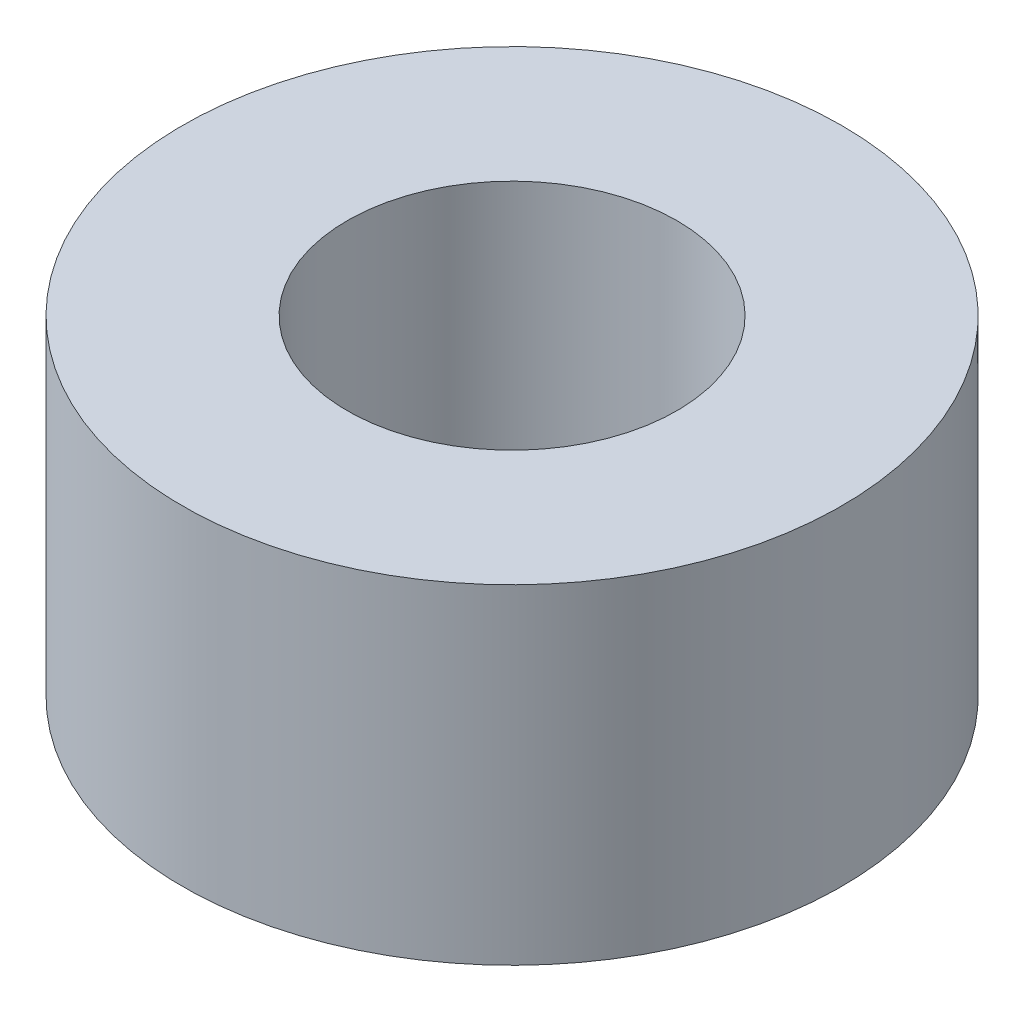
ISO-10303-21;
HEADER;
FILE_DESCRIPTION(('STEP AP214'),'2;1');
FILE_NAME('part.step','',(''),(''),'','','');
FILE_SCHEMA(('AUTOMOTIVE_DESIGN { 1 0 10303 214 1 1 1 1 }'));
ENDSEC;
DATA;
#1=APPLICATION_CONTEXT('core data for automotive mechanical design processes');
#2=APPLICATION_PROTOCOL_DEFINITION('international standard','automotive_design',2000,#1);
#3=PRODUCT_CONTEXT('',#1,'mechanical');
#4=PRODUCT('Part','Part','',(#3));
#5=PRODUCT_RELATED_PRODUCT_CATEGORY('part','',(#4));
#6=PRODUCT_DEFINITION_FORMATION('','',#4);
#7=PRODUCT_DEFINITION_CONTEXT('part definition',#1,'design');
#8=PRODUCT_DEFINITION('design','',#6,#7);
#9=PRODUCT_DEFINITION_SHAPE('','',#8);
#10=(LENGTH_UNIT() NAMED_UNIT(*) SI_UNIT(.MILLI.,.METRE.));
#11=(NAMED_UNIT(*) PLANE_ANGLE_UNIT() SI_UNIT($,.RADIAN.));
#12=(NAMED_UNIT(*) SI_UNIT($,.STERADIAN.) SOLID_ANGLE_UNIT());
#13=UNCERTAINTY_MEASURE_WITH_UNIT(LENGTH_MEASURE(1.E-05),#10,'distance_accuracy_value','');
#14=(GEOMETRIC_REPRESENTATION_CONTEXT(3) GLOBAL_UNCERTAINTY_ASSIGNED_CONTEXT((#13)) GLOBAL_UNIT_ASSIGNED_CONTEXT((#10,
#11,#12)) REPRESENTATION_CONTEXT('',''));
#15=CARTESIAN_POINT('',(0.,0.,0.));
#16=DIRECTION('',(0.,0.,1.));
#17=DIRECTION('',(1.,0.,0.));
#18=AXIS2_PLACEMENT_3D('',#15,#16,#17);
#19=CARTESIAN_POINT('',(0.,-19.05,176.994115114212));
#20=DIRECTION('',(0.,-1.,0.));
#21=DIRECTION('',(0.,0.,-1.));
#22=AXIS2_PLACEMENT_3D('',#19,#20,#21);
#23=CYLINDRICAL_SURFACE('',#22,9.525);
#24=CARTESIAN_POINT('',(0.,0.,176.994115114212));
#25=DIRECTION('',(0.,-1.,0.));
#26=DIRECTION('',(0.,0.,-1.));
#27=AXIS2_PLACEMENT_3D('',#24,#25,#26);
#28=CIRCLE('',#27,9.525);
#29=CARTESIAN_POINT('',(0.,0.,167.469115114212));
#30=VERTEX_POINT('',#29);
#31=EDGE_CURVE('E24',#30,#30,#28,.F.);
#32=ORIENTED_EDGE('',*,*,#31,.T.);
#33=EDGE_LOOP('',(#32));
#34=FACE_BOUND('',#33,.T.);
#35=CARTESIAN_POINT('',(0.,-19.05,176.994115114212));
#36=DIRECTION('',(0.,-1.,0.));
#37=DIRECTION('',(0.,0.,-1.));
#38=AXIS2_PLACEMENT_3D('',#35,#36,#37);
#39=CIRCLE('',#38,9.525);
#40=CARTESIAN_POINT('',(0.,-19.05,167.469115114212));
#41=VERTEX_POINT('',#40);
#42=EDGE_CURVE('E15',#41,#41,#39,.F.);
#43=ORIENTED_EDGE('',*,*,#42,.F.);
#44=EDGE_LOOP('',(#43));
#45=FACE_BOUND('',#44,.T.);
#46=ADVANCED_FACE('F12',(#34,#45),#23,.F.);
#47=CARTESIAN_POINT('',(0.,-19.05,176.994115114212));
#48=DIRECTION('',(0.,-1.,0.));
#49=DIRECTION('',(0.,0.,-1.));
#50=AXIS2_PLACEMENT_3D('',#47,#48,#49);
#51=PLANE('',#50);
#52=CARTESIAN_POINT('',(0.,-19.05,176.994115114212));
#53=DIRECTION('',(0.,-1.,0.));
#54=DIRECTION('',(0.,0.,-1.));
#55=AXIS2_PLACEMENT_3D('',#52,#53,#54);
#56=CIRCLE('',#55,19.05);
#57=CARTESIAN_POINT('',(0.,-19.05,157.944115114212));
#58=VERTEX_POINT('',#57);
#59=EDGE_CURVE('E19',#58,#58,#56,.F.);
#60=ORIENTED_EDGE('',*,*,#59,.F.);
#61=EDGE_LOOP('',(#60));
#62=FACE_BOUND('',#61,.T.);
#63=ORIENTED_EDGE('',*,*,#42,.T.);
#64=EDGE_LOOP('',(#63));
#65=FACE_BOUND('',#64,.T.);
#66=ADVANCED_FACE('F32',(#62,#65),#51,.T.);
#67=CARTESIAN_POINT('',(0.,0.,176.994115114212));
#68=DIRECTION('',(0.,-1.,0.));
#69=DIRECTION('',(0.,0.,-1.));
#70=AXIS2_PLACEMENT_3D('',#67,#68,#69);
#71=PLANE('',#70);
#72=CARTESIAN_POINT('',(0.,0.,176.994115114212));
#73=DIRECTION('',(0.,-1.,0.));
#74=DIRECTION('',(0.,0.,-1.));
#75=AXIS2_PLACEMENT_3D('',#72,#73,#74);
#76=CIRCLE('',#75,19.05);
#77=CARTESIAN_POINT('',(0.,0.,157.944115114212));
#78=VERTEX_POINT('',#77);
#79=EDGE_CURVE('E8',#78,#78,#76,.T.);
#80=ORIENTED_EDGE('',*,*,#79,.F.);
#81=EDGE_LOOP('',(#80));
#82=FACE_BOUND('',#81,.T.);
#83=ORIENTED_EDGE('',*,*,#31,.F.);
#84=EDGE_LOOP('',(#83));
#85=FACE_BOUND('',#84,.T.);
#86=ADVANCED_FACE('F39',(#82,#85),#71,.F.);
#87=CARTESIAN_POINT('',(0.,-19.05,176.994115114212));
#88=DIRECTION('',(0.,-1.,0.));
#89=DIRECTION('',(0.,0.,-1.));
#90=AXIS2_PLACEMENT_3D('',#87,#88,#89);
#91=CYLINDRICAL_SURFACE('',#90,19.05);
#92=ORIENTED_EDGE('',*,*,#79,.T.);
#93=EDGE_LOOP('',(#92));
#94=FACE_BOUND('',#93,.T.);
#95=ORIENTED_EDGE('',*,*,#59,.T.);
#96=EDGE_LOOP('',(#95));
#97=FACE_BOUND('',#96,.T.);
#98=ADVANCED_FACE('F41',(#94,#97),#91,.T.);
#99=CLOSED_SHELL('',(#46,#66,#86,#98));
#100=MANIFOLD_SOLID_BREP('B1',#99);
#101=ADVANCED_BREP_SHAPE_REPRESENTATION('',(#18,#100),#14);
#102=SHAPE_DEFINITION_REPRESENTATION(#9,#101);
ENDSEC;
END-ISO-10303-21;
